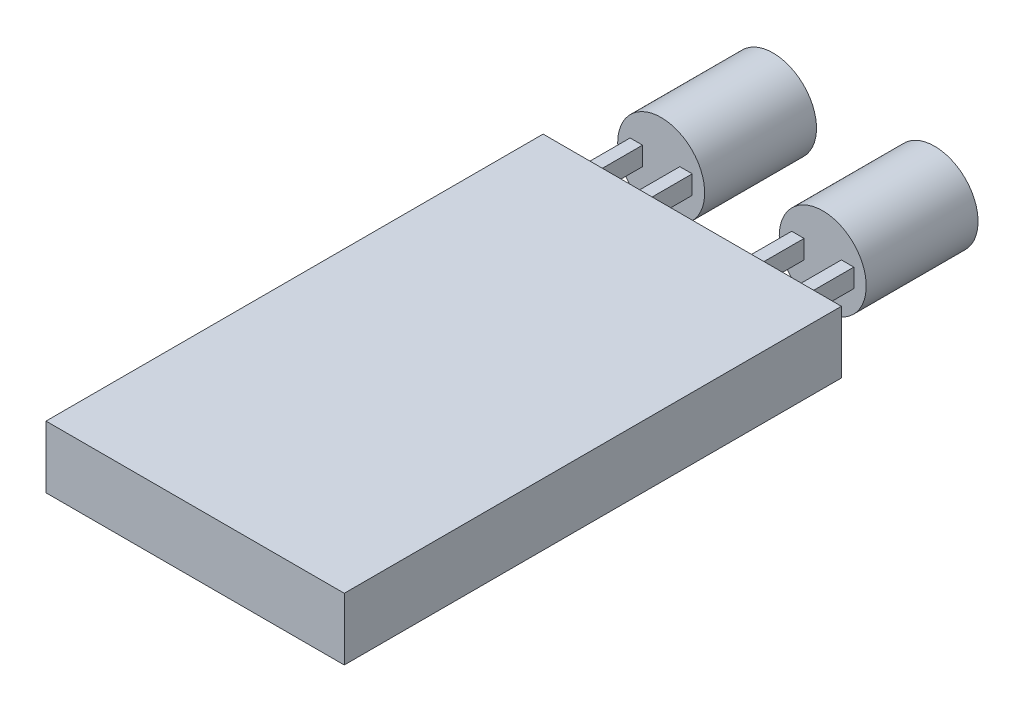
ISO-10303-21;
HEADER;
FILE_DESCRIPTION(('STEP AP214'),'2;1');
FILE_NAME('part.step','',(''),(''),'','','');
FILE_SCHEMA(('AUTOMOTIVE_DESIGN { 1 0 10303 214 1 1 1 1 }'));
ENDSEC;
DATA;
#1=APPLICATION_CONTEXT('core data for automotive mechanical design processes');
#2=APPLICATION_PROTOCOL_DEFINITION('international standard','automotive_design',2000,#1);
#3=PRODUCT_CONTEXT('',#1,'mechanical');
#4=PRODUCT('Part','Part','',(#3));
#5=PRODUCT_RELATED_PRODUCT_CATEGORY('part','',(#4));
#6=PRODUCT_DEFINITION_FORMATION('','',#4);
#7=PRODUCT_DEFINITION_CONTEXT('part definition',#1,'design');
#8=PRODUCT_DEFINITION('design','',#6,#7);
#9=PRODUCT_DEFINITION_SHAPE('','',#8);
#10=(LENGTH_UNIT() NAMED_UNIT(*) SI_UNIT(.MILLI.,.METRE.));
#11=(NAMED_UNIT(*) PLANE_ANGLE_UNIT() SI_UNIT($,.RADIAN.));
#12=(NAMED_UNIT(*) SI_UNIT($,.STERADIAN.) SOLID_ANGLE_UNIT());
#13=UNCERTAINTY_MEASURE_WITH_UNIT(LENGTH_MEASURE(1.E-05),#10,'distance_accuracy_value','');
#14=(GEOMETRIC_REPRESENTATION_CONTEXT(3) GLOBAL_UNCERTAINTY_ASSIGNED_CONTEXT((#13)) GLOBAL_UNIT_ASSIGNED_CONTEXT((#10,
#11,#12)) REPRESENTATION_CONTEXT('',''));
#15=CARTESIAN_POINT('',(0.,0.,0.));
#16=DIRECTION('',(0.,0.,1.));
#17=DIRECTION('',(1.,0.,0.));
#18=AXIS2_PLACEMENT_3D('',#15,#16,#17);
#19=CARTESIAN_POINT('',(-24.,5.,-9.42857142857144));
#20=DIRECTION('',(0.,0.,1.));
#21=DIRECTION('',(1.,0.,0.));
#22=AXIS2_PLACEMENT_3D('',#19,#20,#21);
#23=PLANE('',#22);
#24=DIRECTION('',(1.,0.,0.));
#25=VECTOR('',#24,1.);
#26=CARTESIAN_POINT('',(-16.,4.22951883751348,-9.42857142857144));
#27=LINE('',#26,#25);
#28=CARTESIAN_POINT('',(-17.,4.22951883751348,-9.42857142857144));
#29=VERTEX_POINT('',#28);
#30=CARTESIAN_POINT('',(-16.,4.22951883751348,-9.42857142857144));
#31=VERTEX_POINT('',#30);
#32=EDGE_CURVE('E211',#29,#31,#27,.T.);
#33=ORIENTED_EDGE('',*,*,#32,.F.);
#34=DIRECTION('',(0.,1.,0.));
#35=VECTOR('',#34,1.);
#36=CARTESIAN_POINT('',(-17.,4.22951883751348,-9.42857142857144));
#37=LINE('',#36,#35);
#38=CARTESIAN_POINT('',(-17.,2.72951883751348,-9.42857142857144));
#39=VERTEX_POINT('',#38);
#40=EDGE_CURVE('E216',#39,#29,#37,.T.);
#41=ORIENTED_EDGE('',*,*,#40,.F.);
#42=DIRECTION('',(-1.,0.,0.));
#43=VECTOR('',#42,1.);
#44=CARTESIAN_POINT('',(-16.,2.72951883751348,-9.42857142857144));
#45=LINE('',#44,#43);
#46=CARTESIAN_POINT('',(-16.,2.72951883751348,-9.42857142857144));
#47=VERTEX_POINT('',#46);
#48=EDGE_CURVE('E231',#47,#39,#45,.T.);
#49=ORIENTED_EDGE('',*,*,#48,.F.);
#50=DIRECTION('',(0.,-1.,0.));
#51=VECTOR('',#50,1.);
#52=CARTESIAN_POINT('',(-16.,4.22951883751348,-9.42857142857144));
#53=LINE('',#52,#51);
#54=EDGE_CURVE('E228',#31,#47,#53,.T.);
#55=ORIENTED_EDGE('',*,*,#54,.F.);
#56=EDGE_LOOP('',(#33,#41,#49,#55));
#57=FACE_BOUND('',#56,.T.);
#58=DIRECTION('',(0.,-1.,0.));
#59=VECTOR('',#58,1.);
#60=CARTESIAN_POINT('',(-3.,4.22951883751348,-9.42857142857144));
#61=LINE('',#60,#59);
#62=CARTESIAN_POINT('',(-3.,4.22951883751348,-9.42857142857144));
#63=VERTEX_POINT('',#62);
#64=CARTESIAN_POINT('',(-3.,2.72951883751348,-9.42857142857144));
#65=VERTEX_POINT('',#64);
#66=EDGE_CURVE('E283',#63,#65,#61,.T.);
#67=ORIENTED_EDGE('',*,*,#66,.F.);
#68=DIRECTION('',(1.,0.,0.));
#69=VECTOR('',#68,1.);
#70=CARTESIAN_POINT('',(-3.,4.22951883751348,-9.42857142857144));
#71=LINE('',#70,#69);
#72=CARTESIAN_POINT('',(-4.,4.22951883751348,-9.42857142857144));
#73=VERTEX_POINT('',#72);
#74=EDGE_CURVE('E288',#73,#63,#71,.T.);
#75=ORIENTED_EDGE('',*,*,#74,.F.);
#76=DIRECTION('',(0.,1.,0.));
#77=VECTOR('',#76,1.);
#78=CARTESIAN_POINT('',(-4.,4.22951883751348,-9.42857142857144));
#79=LINE('',#78,#77);
#80=CARTESIAN_POINT('',(-4.,2.72951883751348,-9.42857142857144));
#81=VERTEX_POINT('',#80);
#82=EDGE_CURVE('E303',#81,#73,#79,.T.);
#83=ORIENTED_EDGE('',*,*,#82,.F.);
#84=DIRECTION('',(-1.,0.,0.));
#85=VECTOR('',#84,1.);
#86=CARTESIAN_POINT('',(-3.,2.72951883751348,-9.42857142857144));
#87=LINE('',#86,#85);
#88=EDGE_CURVE('E300',#65,#81,#87,.T.);
#89=ORIENTED_EDGE('',*,*,#88,.F.);
#90=EDGE_LOOP('',(#67,#75,#83,#89));
#91=FACE_BOUND('',#90,.T.);
#92=DIRECTION('',(-1.,0.,0.));
#93=VECTOR('',#92,1.);
#94=CARTESIAN_POINT('',(-24.,0.,-9.42857142857144));
#95=LINE('',#94,#93);
#96=CARTESIAN_POINT('',(0.,0.,-9.42857142857144));
#97=VERTEX_POINT('',#96);
#98=CARTESIAN_POINT('',(-24.,0.,-9.42857142857144));
#99=VERTEX_POINT('',#98);
#100=EDGE_CURVE('E324',#97,#99,#95,.T.);
#101=ORIENTED_EDGE('',*,*,#100,.T.);
#102=DIRECTION('',(0.,-1.,0.));
#103=VECTOR('',#102,1.);
#104=CARTESIAN_POINT('',(-24.,5.,-9.42857142857144));
#105=LINE('',#104,#103);
#106=CARTESIAN_POINT('',(-24.,5.,-9.42857142857144));
#107=VERTEX_POINT('',#106);
#108=EDGE_CURVE('E330',#107,#99,#105,.T.);
#109=ORIENTED_EDGE('',*,*,#108,.F.);
#110=DIRECTION('',(-1.,0.,0.));
#111=VECTOR('',#110,1.);
#112=CARTESIAN_POINT('',(-24.,5.,-9.42857142857144));
#113=LINE('',#112,#111);
#114=CARTESIAN_POINT('',(0.,5.,-9.42857142857144));
#115=VERTEX_POINT('',#114);
#116=EDGE_CURVE('E328',#115,#107,#113,.T.);
#117=ORIENTED_EDGE('',*,*,#116,.F.);
#118=DIRECTION('',(0.,-1.,0.));
#119=VECTOR('',#118,1.);
#120=CARTESIAN_POINT('',(0.,5.,-9.42857142857144));
#121=LINE('',#120,#119);
#122=EDGE_CURVE('E340',#115,#97,#121,.T.);
#123=ORIENTED_EDGE('',*,*,#122,.T.);
#124=EDGE_LOOP('',(#101,#109,#117,#123));
#125=FACE_BOUND('',#124,.T.);
#126=DIRECTION('',(0.,-1.,0.));
#127=VECTOR('',#126,1.);
#128=CARTESIAN_POINT('',(-7.,4.22951883751349,-9.42857142857144));
#129=LINE('',#128,#127);
#130=CARTESIAN_POINT('',(-7.,4.22951883751349,-9.42857142857144));
#131=VERTEX_POINT('',#130);
#132=CARTESIAN_POINT('',(-7.,2.72951883751349,-9.42857142857144));
#133=VERTEX_POINT('',#132);
#134=EDGE_CURVE('E247',#131,#133,#129,.T.);
#135=ORIENTED_EDGE('',*,*,#134,.F.);
#136=DIRECTION('',(1.,0.,0.));
#137=VECTOR('',#136,1.);
#138=CARTESIAN_POINT('',(-7.,4.22951883751349,-9.42857142857144));
#139=LINE('',#138,#137);
#140=CARTESIAN_POINT('',(-8.,4.22951883751349,-9.42857142857144));
#141=VERTEX_POINT('',#140);
#142=EDGE_CURVE('E252',#141,#131,#139,.T.);
#143=ORIENTED_EDGE('',*,*,#142,.F.);
#144=DIRECTION('',(0.,1.,0.));
#145=VECTOR('',#144,1.);
#146=CARTESIAN_POINT('',(-8.,4.22951883751349,-9.42857142857144));
#147=LINE('',#146,#145);
#148=CARTESIAN_POINT('',(-8.,2.72951883751349,-9.42857142857144));
#149=VERTEX_POINT('',#148);
#150=EDGE_CURVE('E267',#149,#141,#147,.T.);
#151=ORIENTED_EDGE('',*,*,#150,.F.);
#152=DIRECTION('',(-1.,0.,0.));
#153=VECTOR('',#152,1.);
#154=CARTESIAN_POINT('',(-7.,2.72951883751349,-9.42857142857144));
#155=LINE('',#154,#153);
#156=EDGE_CURVE('E264',#133,#149,#155,.T.);
#157=ORIENTED_EDGE('',*,*,#156,.F.);
#158=EDGE_LOOP('',(#135,#143,#151,#157));
#159=FACE_BOUND('',#158,.T.);
#160=DIRECTION('',(1.,0.,0.));
#161=VECTOR('',#160,1.);
#162=CARTESIAN_POINT('',(-20.,4.22951883751349,-9.42857142857144));
#163=LINE('',#162,#161);
#164=CARTESIAN_POINT('',(-21.,4.22951883751349,-9.42857142857144));
#165=VERTEX_POINT('',#164);
#166=CARTESIAN_POINT('',(-20.,4.22951883751349,-9.42857142857144));
#167=VERTEX_POINT('',#166);
#168=EDGE_CURVE('E200',#165,#167,#163,.T.);
#169=ORIENTED_EDGE('',*,*,#168,.F.);
#170=DIRECTION('',(0.,1.,0.));
#171=VECTOR('',#170,1.);
#172=CARTESIAN_POINT('',(-21.,4.22951883751349,-9.42857142857144));
#173=LINE('',#172,#171);
#174=CARTESIAN_POINT('',(-21.,2.72951883751349,-9.42857142857144));
#175=VERTEX_POINT('',#174);
#176=EDGE_CURVE('E181',#175,#165,#173,.T.);
#177=ORIENTED_EDGE('',*,*,#176,.F.);
#178=DIRECTION('',(-1.,0.,0.));
#179=VECTOR('',#178,1.);
#180=CARTESIAN_POINT('',(-20.,2.72951883751349,-9.42857142857144));
#181=LINE('',#180,#179);
#182=CARTESIAN_POINT('',(-20.,2.72951883751349,-9.42857142857144));
#183=VERTEX_POINT('',#182);
#184=EDGE_CURVE('E55',#183,#175,#181,.T.);
#185=ORIENTED_EDGE('',*,*,#184,.F.);
#186=DIRECTION('',(0.,-1.,0.));
#187=VECTOR('',#186,1.);
#188=CARTESIAN_POINT('',(-20.,4.22951883751349,-9.42857142857144));
#189=LINE('',#188,#187);
#190=EDGE_CURVE('E50',#167,#183,#189,.T.);
#191=ORIENTED_EDGE('',*,*,#190,.F.);
#192=EDGE_LOOP('',(#169,#177,#185,#191));
#193=FACE_BOUND('',#192,.T.);
#194=ADVANCED_FACE('F35',(#57,#91,#125,#159,#193),#23,.F.);
#195=CARTESIAN_POINT('',(-24.,5.,-9.42857142857144));
#196=DIRECTION('',(1.,0.,0.));
#197=DIRECTION('',(0.,0.,-1.));
#198=AXIS2_PLACEMENT_3D('',#195,#196,#197);
#199=PLANE('',#198);
#200=DIRECTION('',(0.,0.,1.));
#201=VECTOR('',#200,1.);
#202=CARTESIAN_POINT('',(-24.,0.,-9.42857142857144));
#203=LINE('',#202,#201);
#204=CARTESIAN_POINT('',(-24.,0.,30.5714285714286));
#205=VERTEX_POINT('',#204);
#206=EDGE_CURVE('E319',#99,#205,#203,.T.);
#207=ORIENTED_EDGE('',*,*,#206,.T.);
#208=DIRECTION('',(0.,-1.,0.));
#209=VECTOR('',#208,1.);
#210=CARTESIAN_POINT('',(-24.,5.,30.5714285714286));
#211=LINE('',#210,#209);
#212=CARTESIAN_POINT('',(-24.,5.,30.5714285714286));
#213=VERTEX_POINT('',#212);
#214=EDGE_CURVE('E11',#213,#205,#211,.T.);
#215=ORIENTED_EDGE('',*,*,#214,.F.);
#216=DIRECTION('',(0.,0.,1.));
#217=VECTOR('',#216,1.);
#218=CARTESIAN_POINT('',(-24.,5.,-9.42857142857144));
#219=LINE('',#218,#217);
#220=EDGE_CURVE('E320',#107,#213,#219,.T.);
#221=ORIENTED_EDGE('',*,*,#220,.F.);
#222=ORIENTED_EDGE('',*,*,#108,.T.);
#223=EDGE_LOOP('',(#207,#215,#221,#222));
#224=FACE_BOUND('',#223,.T.);
#225=ADVANCED_FACE('F37',(#224),#199,.F.);
#226=CARTESIAN_POINT('',(-24.,5.,30.5714285714286));
#227=DIRECTION('',(0.,0.,-1.));
#228=DIRECTION('',(-1.,0.,0.));
#229=AXIS2_PLACEMENT_3D('',#226,#227,#228);
#230=PLANE('',#229);
#231=DIRECTION('',(1.,0.,0.));
#232=VECTOR('',#231,1.);
#233=CARTESIAN_POINT('',(-24.,0.,30.5714285714286));
#234=LINE('',#233,#232);
#235=CARTESIAN_POINT('',(0.,0.,30.5714285714286));
#236=VERTEX_POINT('',#235);
#237=EDGE_CURVE('E333',#205,#236,#234,.T.);
#238=ORIENTED_EDGE('',*,*,#237,.T.);
#239=DIRECTION('',(0.,-1.,0.));
#240=VECTOR('',#239,1.);
#241=CARTESIAN_POINT('',(0.,5.,30.5714285714286));
#242=LINE('',#241,#240);
#243=CARTESIAN_POINT('',(0.,5.,30.5714285714286));
#244=VERTEX_POINT('',#243);
#245=EDGE_CURVE('E43',#244,#236,#242,.T.);
#246=ORIENTED_EDGE('',*,*,#245,.F.);
#247=DIRECTION('',(1.,0.,0.));
#248=VECTOR('',#247,1.);
#249=CARTESIAN_POINT('',(-24.,5.,30.5714285714286));
#250=LINE('',#249,#248);
#251=EDGE_CURVE('E323',#213,#244,#250,.T.);
#252=ORIENTED_EDGE('',*,*,#251,.F.);
#253=ORIENTED_EDGE('',*,*,#214,.T.);
#254=EDGE_LOOP('',(#238,#246,#252,#253));
#255=FACE_BOUND('',#254,.T.);
#256=ADVANCED_FACE('F363',(#255),#230,.F.);
#257=CARTESIAN_POINT('',(0.,5.,-9.42857142857144));
#258=DIRECTION('',(-1.,0.,0.));
#259=DIRECTION('',(0.,0.,1.));
#260=AXIS2_PLACEMENT_3D('',#257,#258,#259);
#261=PLANE('',#260);
#262=DIRECTION('',(0.,0.,-1.));
#263=VECTOR('',#262,1.);
#264=CARTESIAN_POINT('',(0.,0.,-9.42857142857144));
#265=LINE('',#264,#263);
#266=EDGE_CURVE('E335',#236,#97,#265,.T.);
#267=ORIENTED_EDGE('',*,*,#266,.T.);
#268=ORIENTED_EDGE('',*,*,#122,.F.);
#269=DIRECTION('',(0.,0.,-1.));
#270=VECTOR('',#269,1.);
#271=CARTESIAN_POINT('',(0.,5.,-9.42857142857144));
#272=LINE('',#271,#270);
#273=EDGE_CURVE('E326',#244,#115,#272,.T.);
#274=ORIENTED_EDGE('',*,*,#273,.F.);
#275=ORIENTED_EDGE('',*,*,#245,.T.);
#276=EDGE_LOOP('',(#267,#268,#274,#275));
#277=FACE_BOUND('',#276,.T.);
#278=ADVANCED_FACE('F347',(#277),#261,.F.);
#279=CARTESIAN_POINT('',(0.,5.,0.));
#280=DIRECTION('',(0.,1.,0.));
#281=DIRECTION('',(0.,0.,1.));
#282=AXIS2_PLACEMENT_3D('',#279,#280,#281);
#283=PLANE('',#282);
#284=ORIENTED_EDGE('',*,*,#220,.T.);
#285=ORIENTED_EDGE('',*,*,#251,.T.);
#286=ORIENTED_EDGE('',*,*,#273,.T.);
#287=ORIENTED_EDGE('',*,*,#116,.T.);
#288=EDGE_LOOP('',(#284,#285,#286,#287));
#289=FACE_BOUND('',#288,.T.);
#290=ADVANCED_FACE('F362',(#289),#283,.T.);
#291=CARTESIAN_POINT('',(0.,0.,0.));
#292=DIRECTION('',(0.,1.,0.));
#293=DIRECTION('',(0.,0.,1.));
#294=AXIS2_PLACEMENT_3D('',#291,#292,#293);
#295=PLANE('',#294);
#296=ORIENTED_EDGE('',*,*,#206,.F.);
#297=ORIENTED_EDGE('',*,*,#100,.F.);
#298=ORIENTED_EDGE('',*,*,#266,.F.);
#299=ORIENTED_EDGE('',*,*,#237,.F.);
#300=EDGE_LOOP('',(#296,#297,#298,#299));
#301=FACE_BOUND('',#300,.T.);
#302=ADVANCED_FACE('F353',(#301),#295,.F.);
#303=CARTESIAN_POINT('',(-3.,4.22951883751348,-13.4285714285714));
#304=DIRECTION('',(-1.,0.,0.));
#305=DIRECTION('',(0.,0.,1.));
#306=AXIS2_PLACEMENT_3D('',#303,#304,#305);
#307=PLANE('',#306);
#308=ORIENTED_EDGE('',*,*,#66,.T.);
#309=DIRECTION('',(0.,0.,1.));
#310=VECTOR('',#309,1.);
#311=CARTESIAN_POINT('',(-3.,2.72951883751348,-13.4285714285714));
#312=LINE('',#311,#310);
#313=CARTESIAN_POINT('',(-3.,2.72951883751348,-13.4285714285714));
#314=VERTEX_POINT('',#313);
#315=EDGE_CURVE('E316',#314,#65,#312,.T.);
#316=ORIENTED_EDGE('',*,*,#315,.F.);
#317=DIRECTION('',(0.,-1.,0.));
#318=VECTOR('',#317,1.);
#319=CARTESIAN_POINT('',(-3.,4.22951883751348,-13.4285714285714));
#320=LINE('',#319,#318);
#321=CARTESIAN_POINT('',(-3.,4.22951883751348,-13.4285714285714));
#322=VERTEX_POINT('',#321);
#323=EDGE_CURVE('E284',#322,#314,#320,.T.);
#324=ORIENTED_EDGE('',*,*,#323,.F.);
#325=DIRECTION('',(0.,0.,1.));
#326=VECTOR('',#325,1.);
#327=CARTESIAN_POINT('',(-3.,4.22951883751348,-13.4285714285714));
#328=LINE('',#327,#326);
#329=EDGE_CURVE('E297',#322,#63,#328,.T.);
#330=ORIENTED_EDGE('',*,*,#329,.T.);
#331=EDGE_LOOP('',(#308,#316,#324,#330));
#332=FACE_BOUND('',#331,.T.);
#333=ADVANCED_FACE('F379',(#332),#307,.F.);
#334=CARTESIAN_POINT('',(-3.,2.72951883751348,-13.4285714285714));
#335=DIRECTION('',(0.,1.,0.));
#336=DIRECTION('',(0.,0.,1.));
#337=AXIS2_PLACEMENT_3D('',#334,#335,#336);
#338=PLANE('',#337);
#339=ORIENTED_EDGE('',*,*,#88,.T.);
#340=DIRECTION('',(0.,0.,1.));
#341=VECTOR('',#340,1.);
#342=CARTESIAN_POINT('',(-4.,2.72951883751348,-13.4285714285714));
#343=LINE('',#342,#341);
#344=CARTESIAN_POINT('',(-4.,2.72951883751348,-13.4285714285714));
#345=VERTEX_POINT('',#344);
#346=EDGE_CURVE('E313',#345,#81,#343,.T.);
#347=ORIENTED_EDGE('',*,*,#346,.F.);
#348=DIRECTION('',(-1.,0.,0.));
#349=VECTOR('',#348,1.);
#350=CARTESIAN_POINT('',(-3.,2.72951883751348,-13.4285714285714));
#351=LINE('',#350,#349);
#352=EDGE_CURVE('E287',#314,#345,#351,.T.);
#353=ORIENTED_EDGE('',*,*,#352,.F.);
#354=ORIENTED_EDGE('',*,*,#315,.T.);
#355=EDGE_LOOP('',(#339,#347,#353,#354));
#356=FACE_BOUND('',#355,.T.);
#357=ADVANCED_FACE('F384',(#356),#338,.F.);
#358=CARTESIAN_POINT('',(-4.,4.22951883751348,-13.4285714285714));
#359=DIRECTION('',(1.,0.,0.));
#360=DIRECTION('',(0.,0.,-1.));
#361=AXIS2_PLACEMENT_3D('',#358,#359,#360);
#362=PLANE('',#361);
#363=ORIENTED_EDGE('',*,*,#82,.T.);
#364=DIRECTION('',(0.,0.,1.));
#365=VECTOR('',#364,1.);
#366=CARTESIAN_POINT('',(-4.,4.22951883751348,-13.4285714285714));
#367=LINE('',#366,#365);
#368=CARTESIAN_POINT('',(-4.,4.22951883751348,-13.4285714285714));
#369=VERTEX_POINT('',#368);
#370=EDGE_CURVE('E310',#369,#73,#367,.T.);
#371=ORIENTED_EDGE('',*,*,#370,.F.);
#372=DIRECTION('',(0.,1.,0.));
#373=VECTOR('',#372,1.);
#374=CARTESIAN_POINT('',(-4.,4.22951883751348,-13.4285714285714));
#375=LINE('',#374,#373);
#376=EDGE_CURVE('E291',#345,#369,#375,.T.);
#377=ORIENTED_EDGE('',*,*,#376,.F.);
#378=ORIENTED_EDGE('',*,*,#346,.T.);
#379=EDGE_LOOP('',(#363,#371,#377,#378));
#380=FACE_BOUND('',#379,.T.);
#381=ADVANCED_FACE('F388',(#380),#362,.F.);
#382=CARTESIAN_POINT('',(-3.,4.22951883751348,-13.4285714285714));
#383=DIRECTION('',(0.,-1.,0.));
#384=DIRECTION('',(0.,0.,-1.));
#385=AXIS2_PLACEMENT_3D('',#382,#383,#384);
#386=PLANE('',#385);
#387=ORIENTED_EDGE('',*,*,#74,.T.);
#388=ORIENTED_EDGE('',*,*,#329,.F.);
#389=DIRECTION('',(1.,0.,0.));
#390=VECTOR('',#389,1.);
#391=CARTESIAN_POINT('',(-3.,4.22951883751348,-13.4285714285714));
#392=LINE('',#391,#390);
#393=EDGE_CURVE('E294',#369,#322,#392,.T.);
#394=ORIENTED_EDGE('',*,*,#393,.F.);
#395=ORIENTED_EDGE('',*,*,#370,.T.);
#396=EDGE_LOOP('',(#387,#388,#394,#395));
#397=FACE_BOUND('',#396,.T.);
#398=ADVANCED_FACE('F392',(#397),#386,.F.);
#399=CARTESIAN_POINT('',(-7.,4.22951883751349,-13.4285714285714));
#400=DIRECTION('',(-1.,0.,0.));
#401=DIRECTION('',(0.,0.,1.));
#402=AXIS2_PLACEMENT_3D('',#399,#400,#401);
#403=PLANE('',#402);
#404=ORIENTED_EDGE('',*,*,#134,.T.);
#405=DIRECTION('',(0.,0.,1.));
#406=VECTOR('',#405,1.);
#407=CARTESIAN_POINT('',(-7.,2.72951883751349,-13.4285714285714));
#408=LINE('',#407,#406);
#409=CARTESIAN_POINT('',(-7.,2.72951883751349,-13.4285714285714));
#410=VERTEX_POINT('',#409);
#411=EDGE_CURVE('E280',#410,#133,#408,.T.);
#412=ORIENTED_EDGE('',*,*,#411,.F.);
#413=DIRECTION('',(0.,-1.,0.));
#414=VECTOR('',#413,1.);
#415=CARTESIAN_POINT('',(-7.,4.22951883751349,-13.4285714285714));
#416=LINE('',#415,#414);
#417=CARTESIAN_POINT('',(-7.,4.22951883751349,-13.4285714285714));
#418=VERTEX_POINT('',#417);
#419=EDGE_CURVE('E248',#418,#410,#416,.T.);
#420=ORIENTED_EDGE('',*,*,#419,.F.);
#421=DIRECTION('',(0.,0.,1.));
#422=VECTOR('',#421,1.);
#423=CARTESIAN_POINT('',(-7.,4.22951883751349,-13.4285714285714));
#424=LINE('',#423,#422);
#425=EDGE_CURVE('E261',#418,#131,#424,.T.);
#426=ORIENTED_EDGE('',*,*,#425,.T.);
#427=EDGE_LOOP('',(#404,#412,#420,#426));
#428=FACE_BOUND('',#427,.T.);
#429=ADVANCED_FACE('F396',(#428),#403,.F.);
#430=CARTESIAN_POINT('',(-7.,2.72951883751349,-13.4285714285714));
#431=DIRECTION('',(0.,1.,0.));
#432=DIRECTION('',(-1.,0.,0.));
#433=AXIS2_PLACEMENT_3D('',#430,#431,#432);
#434=PLANE('',#433);
#435=ORIENTED_EDGE('',*,*,#156,.T.);
#436=DIRECTION('',(0.,0.,1.));
#437=VECTOR('',#436,1.);
#438=CARTESIAN_POINT('',(-8.,2.72951883751349,-13.4285714285714));
#439=LINE('',#438,#437);
#440=CARTESIAN_POINT('',(-8.,2.72951883751349,-13.4285714285714));
#441=VERTEX_POINT('',#440);
#442=EDGE_CURVE('E277',#441,#149,#439,.T.);
#443=ORIENTED_EDGE('',*,*,#442,.F.);
#444=DIRECTION('',(-1.,0.,0.));
#445=VECTOR('',#444,1.);
#446=CARTESIAN_POINT('',(-7.,2.72951883751349,-13.4285714285714));
#447=LINE('',#446,#445);
#448=EDGE_CURVE('E251',#410,#441,#447,.T.);
#449=ORIENTED_EDGE('',*,*,#448,.F.);
#450=ORIENTED_EDGE('',*,*,#411,.T.);
#451=EDGE_LOOP('',(#435,#443,#449,#450));
#452=FACE_BOUND('',#451,.T.);
#453=ADVANCED_FACE('F400',(#452),#434,.F.);
#454=CARTESIAN_POINT('',(-8.,4.22951883751349,-13.4285714285714));
#455=DIRECTION('',(1.,0.,0.));
#456=DIRECTION('',(0.,1.,0.));
#457=AXIS2_PLACEMENT_3D('',#454,#455,#456);
#458=PLANE('',#457);
#459=ORIENTED_EDGE('',*,*,#150,.T.);
#460=DIRECTION('',(0.,0.,1.));
#461=VECTOR('',#460,1.);
#462=CARTESIAN_POINT('',(-8.,4.22951883751349,-13.4285714285714));
#463=LINE('',#462,#461);
#464=CARTESIAN_POINT('',(-8.,4.22951883751349,-13.4285714285714));
#465=VERTEX_POINT('',#464);
#466=EDGE_CURVE('E274',#465,#141,#463,.T.);
#467=ORIENTED_EDGE('',*,*,#466,.F.);
#468=DIRECTION('',(0.,1.,0.));
#469=VECTOR('',#468,1.);
#470=CARTESIAN_POINT('',(-8.,4.22951883751349,-13.4285714285714));
#471=LINE('',#470,#469);
#472=EDGE_CURVE('E255',#441,#465,#471,.T.);
#473=ORIENTED_EDGE('',*,*,#472,.F.);
#474=ORIENTED_EDGE('',*,*,#442,.T.);
#475=EDGE_LOOP('',(#459,#467,#473,#474));
#476=FACE_BOUND('',#475,.T.);
#477=ADVANCED_FACE('F404',(#476),#458,.F.);
#478=CARTESIAN_POINT('',(-7.,4.22951883751349,-13.4285714285714));
#479=DIRECTION('',(0.,-1.,0.));
#480=DIRECTION('',(0.,0.,-1.));
#481=AXIS2_PLACEMENT_3D('',#478,#479,#480);
#482=PLANE('',#481);
#483=ORIENTED_EDGE('',*,*,#142,.T.);
#484=ORIENTED_EDGE('',*,*,#425,.F.);
#485=DIRECTION('',(1.,0.,0.));
#486=VECTOR('',#485,1.);
#487=CARTESIAN_POINT('',(-7.,4.22951883751349,-13.4285714285714));
#488=LINE('',#487,#486);
#489=EDGE_CURVE('E258',#465,#418,#488,.T.);
#490=ORIENTED_EDGE('',*,*,#489,.F.);
#491=ORIENTED_EDGE('',*,*,#466,.T.);
#492=EDGE_LOOP('',(#483,#484,#490,#491));
#493=FACE_BOUND('',#492,.T.);
#494=ADVANCED_FACE('F408',(#493),#482,.F.);
#495=CARTESIAN_POINT('',(-16.,4.22951883751348,-13.4285714285714));
#496=DIRECTION('',(0.,-1.,0.));
#497=DIRECTION('',(0.,0.,-1.));
#498=AXIS2_PLACEMENT_3D('',#495,#496,#497);
#499=PLANE('',#498);
#500=ORIENTED_EDGE('',*,*,#32,.T.);
#501=DIRECTION('',(0.,0.,1.));
#502=VECTOR('',#501,1.);
#503=CARTESIAN_POINT('',(-16.,4.22951883751348,-13.4285714285714));
#504=LINE('',#503,#502);
#505=CARTESIAN_POINT('',(-16.,4.22951883751348,-13.4285714285714));
#506=VERTEX_POINT('',#505);
#507=EDGE_CURVE('E244',#506,#31,#504,.T.);
#508=ORIENTED_EDGE('',*,*,#507,.F.);
#509=DIRECTION('',(1.,0.,0.));
#510=VECTOR('',#509,1.);
#511=CARTESIAN_POINT('',(-16.,4.22951883751348,-13.4285714285714));
#512=LINE('',#511,#510);
#513=CARTESIAN_POINT('',(-17.,4.22951883751348,-13.4285714285714));
#514=VERTEX_POINT('',#513);
#515=EDGE_CURVE('E212',#514,#506,#512,.T.);
#516=ORIENTED_EDGE('',*,*,#515,.F.);
#517=DIRECTION('',(0.,0.,1.));
#518=VECTOR('',#517,1.);
#519=CARTESIAN_POINT('',(-17.,4.22951883751348,-13.4285714285714));
#520=LINE('',#519,#518);
#521=EDGE_CURVE('E225',#514,#29,#520,.T.);
#522=ORIENTED_EDGE('',*,*,#521,.T.);
#523=EDGE_LOOP('',(#500,#508,#516,#522));
#524=FACE_BOUND('',#523,.T.);
#525=ADVANCED_FACE('F412',(#524),#499,.F.);
#526=CARTESIAN_POINT('',(-16.,4.22951883751348,-13.4285714285714));
#527=DIRECTION('',(-1.,0.,0.));
#528=DIRECTION('',(0.,0.,1.));
#529=AXIS2_PLACEMENT_3D('',#526,#527,#528);
#530=PLANE('',#529);
#531=ORIENTED_EDGE('',*,*,#54,.T.);
#532=DIRECTION('',(0.,0.,1.));
#533=VECTOR('',#532,1.);
#534=CARTESIAN_POINT('',(-16.,2.72951883751348,-13.4285714285714));
#535=LINE('',#534,#533);
#536=CARTESIAN_POINT('',(-16.,2.72951883751348,-13.4285714285714));
#537=VERTEX_POINT('',#536);
#538=EDGE_CURVE('E241',#537,#47,#535,.T.);
#539=ORIENTED_EDGE('',*,*,#538,.F.);
#540=DIRECTION('',(0.,-1.,0.));
#541=VECTOR('',#540,1.);
#542=CARTESIAN_POINT('',(-16.,4.22951883751348,-13.4285714285714));
#543=LINE('',#542,#541);
#544=EDGE_CURVE('E215',#506,#537,#543,.T.);
#545=ORIENTED_EDGE('',*,*,#544,.F.);
#546=ORIENTED_EDGE('',*,*,#507,.T.);
#547=EDGE_LOOP('',(#531,#539,#545,#546));
#548=FACE_BOUND('',#547,.T.);
#549=ADVANCED_FACE('F416',(#548),#530,.F.);
#550=CARTESIAN_POINT('',(-16.,2.72951883751348,-13.4285714285714));
#551=DIRECTION('',(0.,1.,0.));
#552=DIRECTION('',(0.,0.,1.));
#553=AXIS2_PLACEMENT_3D('',#550,#551,#552);
#554=PLANE('',#553);
#555=ORIENTED_EDGE('',*,*,#48,.T.);
#556=DIRECTION('',(0.,0.,1.));
#557=VECTOR('',#556,1.);
#558=CARTESIAN_POINT('',(-17.,2.72951883751348,-13.4285714285714));
#559=LINE('',#558,#557);
#560=CARTESIAN_POINT('',(-17.,2.72951883751348,-13.4285714285714));
#561=VERTEX_POINT('',#560);
#562=EDGE_CURVE('E238',#561,#39,#559,.T.);
#563=ORIENTED_EDGE('',*,*,#562,.F.);
#564=DIRECTION('',(-1.,0.,0.));
#565=VECTOR('',#564,1.);
#566=CARTESIAN_POINT('',(-16.,2.72951883751348,-13.4285714285714));
#567=LINE('',#566,#565);
#568=EDGE_CURVE('E219',#537,#561,#567,.T.);
#569=ORIENTED_EDGE('',*,*,#568,.F.);
#570=ORIENTED_EDGE('',*,*,#538,.T.);
#571=EDGE_LOOP('',(#555,#563,#569,#570));
#572=FACE_BOUND('',#571,.T.);
#573=ADVANCED_FACE('F420',(#572),#554,.F.);
#574=CARTESIAN_POINT('',(-17.,4.22951883751348,-13.4285714285714));
#575=DIRECTION('',(1.,0.,0.));
#576=DIRECTION('',(0.,0.,-1.));
#577=AXIS2_PLACEMENT_3D('',#574,#575,#576);
#578=PLANE('',#577);
#579=ORIENTED_EDGE('',*,*,#40,.T.);
#580=ORIENTED_EDGE('',*,*,#521,.F.);
#581=DIRECTION('',(0.,1.,0.));
#582=VECTOR('',#581,1.);
#583=CARTESIAN_POINT('',(-17.,4.22951883751348,-13.4285714285714));
#584=LINE('',#583,#582);
#585=EDGE_CURVE('E222',#561,#514,#584,.T.);
#586=ORIENTED_EDGE('',*,*,#585,.F.);
#587=ORIENTED_EDGE('',*,*,#562,.T.);
#588=EDGE_LOOP('',(#579,#580,#586,#587));
#589=FACE_BOUND('',#588,.T.);
#590=ADVANCED_FACE('F424',(#589),#578,.F.);
#591=CARTESIAN_POINT('',(-20.,4.22951883751349,-13.4285714285714));
#592=DIRECTION('',(0.,-1.,0.));
#593=DIRECTION('',(0.,0.,-1.));
#594=AXIS2_PLACEMENT_3D('',#591,#592,#593);
#595=PLANE('',#594);
#596=ORIENTED_EDGE('',*,*,#168,.T.);
#597=DIRECTION('',(0.,0.,1.));
#598=VECTOR('',#597,1.);
#599=CARTESIAN_POINT('',(-20.,4.22951883751349,-13.4285714285714));
#600=LINE('',#599,#598);
#601=CARTESIAN_POINT('',(-20.,4.22951883751349,-13.4285714285714));
#602=VERTEX_POINT('',#601);
#603=EDGE_CURVE('E176',#602,#167,#600,.T.);
#604=ORIENTED_EDGE('',*,*,#603,.F.);
#605=DIRECTION('',(1.,0.,0.));
#606=VECTOR('',#605,1.);
#607=CARTESIAN_POINT('',(-20.,4.22951883751349,-13.4285714285714));
#608=LINE('',#607,#606);
#609=CARTESIAN_POINT('',(-21.,4.22951883751349,-13.4285714285714));
#610=VERTEX_POINT('',#609);
#611=EDGE_CURVE('E171',#610,#602,#608,.T.);
#612=ORIENTED_EDGE('',*,*,#611,.F.);
#613=DIRECTION('',(0.,0.,1.));
#614=VECTOR('',#613,1.);
#615=CARTESIAN_POINT('',(-21.,4.22951883751349,-13.4285714285714));
#616=LINE('',#615,#614);
#617=EDGE_CURVE('E175',#610,#165,#616,.T.);
#618=ORIENTED_EDGE('',*,*,#617,.T.);
#619=EDGE_LOOP('',(#596,#604,#612,#618));
#620=FACE_BOUND('',#619,.T.);
#621=ADVANCED_FACE('F174',(#620),#595,.F.);
#622=CARTESIAN_POINT('',(-20.,4.22951883751349,-13.4285714285714));
#623=DIRECTION('',(-1.,0.,0.));
#624=DIRECTION('',(0.,0.,1.));
#625=AXIS2_PLACEMENT_3D('',#622,#623,#624);
#626=PLANE('',#625);
#627=ORIENTED_EDGE('',*,*,#190,.T.);
#628=DIRECTION('',(0.,0.,1.));
#629=VECTOR('',#628,1.);
#630=CARTESIAN_POINT('',(-20.,2.72951883751349,-13.4285714285714));
#631=LINE('',#630,#629);
#632=CARTESIAN_POINT('',(-20.,2.72951883751349,-13.4285714285714));
#633=VERTEX_POINT('',#632);
#634=EDGE_CURVE('E207',#633,#183,#631,.T.);
#635=ORIENTED_EDGE('',*,*,#634,.F.);
#636=DIRECTION('',(0.,-1.,0.));
#637=VECTOR('',#636,1.);
#638=CARTESIAN_POINT('',(-20.,4.22951883751349,-13.4285714285714));
#639=LINE('',#638,#637);
#640=EDGE_CURVE('E180',#602,#633,#639,.T.);
#641=ORIENTED_EDGE('',*,*,#640,.F.);
#642=ORIENTED_EDGE('',*,*,#603,.T.);
#643=EDGE_LOOP('',(#627,#635,#641,#642));
#644=FACE_BOUND('',#643,.T.);
#645=ADVANCED_FACE('F431',(#644),#626,.F.);
#646=CARTESIAN_POINT('',(-20.,2.72951883751349,-13.4285714285714));
#647=DIRECTION('',(0.,1.,0.));
#648=DIRECTION('',(-1.,0.,0.));
#649=AXIS2_PLACEMENT_3D('',#646,#647,#648);
#650=PLANE('',#649);
#651=ORIENTED_EDGE('',*,*,#184,.T.);
#652=DIRECTION('',(0.,0.,1.));
#653=VECTOR('',#652,1.);
#654=CARTESIAN_POINT('',(-21.,2.72951883751349,-13.4285714285714));
#655=LINE('',#654,#653);
#656=CARTESIAN_POINT('',(-21.,2.72951883751349,-13.4285714285714));
#657=VERTEX_POINT('',#656);
#658=EDGE_CURVE('E190',#657,#175,#655,.T.);
#659=ORIENTED_EDGE('',*,*,#658,.F.);
#660=DIRECTION('',(-1.,0.,0.));
#661=VECTOR('',#660,1.);
#662=CARTESIAN_POINT('',(-20.,2.72951883751349,-13.4285714285714));
#663=LINE('',#662,#661);
#664=EDGE_CURVE('E195',#633,#657,#663,.T.);
#665=ORIENTED_EDGE('',*,*,#664,.F.);
#666=ORIENTED_EDGE('',*,*,#634,.T.);
#667=EDGE_LOOP('',(#651,#659,#665,#666));
#668=FACE_BOUND('',#667,.T.);
#669=ADVANCED_FACE('F434',(#668),#650,.F.);
#670=CARTESIAN_POINT('',(-21.,4.22951883751349,-13.4285714285714));
#671=DIRECTION('',(1.,0.,0.));
#672=DIRECTION('',(0.,0.,-1.));
#673=AXIS2_PLACEMENT_3D('',#670,#671,#672);
#674=PLANE('',#673);
#675=ORIENTED_EDGE('',*,*,#176,.T.);
#676=ORIENTED_EDGE('',*,*,#617,.F.);
#677=DIRECTION('',(0.,1.,0.));
#678=VECTOR('',#677,1.);
#679=CARTESIAN_POINT('',(-21.,4.22951883751349,-13.4285714285714));
#680=LINE('',#679,#678);
#681=EDGE_CURVE('E188',#657,#610,#680,.T.);
#682=ORIENTED_EDGE('',*,*,#681,.F.);
#683=ORIENTED_EDGE('',*,*,#658,.T.);
#684=EDGE_LOOP('',(#675,#676,#682,#683));
#685=FACE_BOUND('',#684,.T.);
#686=ADVANCED_FACE('F186',(#685),#674,.F.);
#687=CARTESIAN_POINT('',(-5.5,3.40608752970275,-13.4285714285714));
#688=DIRECTION('',(0.,0.,-1.));
#689=DIRECTION('',(-1.,0.,0.));
#690=AXIS2_PLACEMENT_3D('',#687,#688,#689);
#691=PLANE('',#690);
#692=ORIENTED_EDGE('',*,*,#489,.T.);
#693=ORIENTED_EDGE('',*,*,#419,.T.);
#694=ORIENTED_EDGE('',*,*,#448,.T.);
#695=ORIENTED_EDGE('',*,*,#472,.T.);
#696=EDGE_LOOP('',(#692,#693,#694,#695));
#697=FACE_BOUND('',#696,.T.);
#698=CARTESIAN_POINT('',(-5.5,3.40608752970275,-13.4285714285714));
#699=DIRECTION('',(0.,0.,-1.));
#700=DIRECTION('',(-1.,0.,0.));
#701=AXIS2_PLACEMENT_3D('',#698,#699,#700);
#702=CIRCLE('',#701,3.5);
#703=CARTESIAN_POINT('',(-9.,3.40608752970275,-13.4285714285714));
#704=VERTEX_POINT('',#703);
#705=EDGE_CURVE('E467',#704,#704,#702,.T.);
#706=ORIENTED_EDGE('',*,*,#705,.F.);
#707=EDGE_LOOP('',(#706));
#708=FACE_BOUND('',#707,.T.);
#709=ORIENTED_EDGE('',*,*,#393,.T.);
#710=ORIENTED_EDGE('',*,*,#323,.T.);
#711=ORIENTED_EDGE('',*,*,#352,.T.);
#712=ORIENTED_EDGE('',*,*,#376,.T.);
#713=EDGE_LOOP('',(#709,#710,#711,#712));
#714=FACE_BOUND('',#713,.T.);
#715=ADVANCED_FACE('F441',(#697,#708,#714),#691,.F.);
#716=CARTESIAN_POINT('',(-5.5,3.40608752970275,-22.4285714285714));
#717=DIRECTION('',(0.,0.,1.));
#718=DIRECTION('',(1.,0.,0.));
#719=AXIS2_PLACEMENT_3D('',#716,#717,#718);
#720=CYLINDRICAL_SURFACE('',#719,3.5);
#721=CARTESIAN_POINT('',(-5.5,3.40608752970275,-22.4285714285714));
#722=DIRECTION('',(0.,0.,-1.));
#723=DIRECTION('',(-1.,0.,0.));
#724=AXIS2_PLACEMENT_3D('',#721,#722,#723);
#725=CIRCLE('',#724,3.5);
#726=CARTESIAN_POINT('',(-9.,3.40608752970275,-22.4285714285714));
#727=VERTEX_POINT('',#726);
#728=EDGE_CURVE('E202',#727,#727,#725,.T.);
#729=ORIENTED_EDGE('',*,*,#728,.F.);
#730=EDGE_LOOP('',(#729));
#731=FACE_BOUND('',#730,.T.);
#732=ORIENTED_EDGE('',*,*,#705,.T.);
#733=EDGE_LOOP('',(#732));
#734=FACE_BOUND('',#733,.T.);
#735=ADVANCED_FACE('F442',(#731,#734),#720,.T.);
#736=CARTESIAN_POINT('',(-5.5,3.40608752970275,-22.4285714285714));
#737=DIRECTION('',(0.,0.,-1.));
#738=DIRECTION('',(-1.,0.,0.));
#739=AXIS2_PLACEMENT_3D('',#736,#737,#738);
#740=PLANE('',#739);
#741=ORIENTED_EDGE('',*,*,#728,.T.);
#742=EDGE_LOOP('',(#741));
#743=FACE_BOUND('',#742,.T.);
#744=ADVANCED_FACE('F445',(#743),#740,.T.);
#745=CARTESIAN_POINT('',(-18.5,3.40608752970275,-13.4285714285714));
#746=DIRECTION('',(0.,0.,-1.));
#747=DIRECTION('',(-1.,0.,0.));
#748=AXIS2_PLACEMENT_3D('',#745,#746,#747);
#749=PLANE('',#748);
#750=ORIENTED_EDGE('',*,*,#681,.T.);
#751=ORIENTED_EDGE('',*,*,#611,.T.);
#752=ORIENTED_EDGE('',*,*,#640,.T.);
#753=ORIENTED_EDGE('',*,*,#664,.T.);
#754=EDGE_LOOP('',(#750,#751,#752,#753));
#755=FACE_BOUND('',#754,.T.);
#756=CARTESIAN_POINT('',(-18.5,3.40608752970275,-13.4285714285714));
#757=DIRECTION('',(0.,0.,-1.));
#758=DIRECTION('',(-1.,0.,0.));
#759=AXIS2_PLACEMENT_3D('',#756,#757,#758);
#760=CIRCLE('',#759,3.5);
#761=CARTESIAN_POINT('',(-22.,3.40608752970275,-13.4285714285714));
#762=VERTEX_POINT('',#761);
#763=EDGE_CURVE('E468',#762,#762,#760,.T.);
#764=ORIENTED_EDGE('',*,*,#763,.F.);
#765=EDGE_LOOP('',(#764));
#766=FACE_BOUND('',#765,.T.);
#767=ORIENTED_EDGE('',*,*,#585,.T.);
#768=ORIENTED_EDGE('',*,*,#515,.T.);
#769=ORIENTED_EDGE('',*,*,#544,.T.);
#770=ORIENTED_EDGE('',*,*,#568,.T.);
#771=EDGE_LOOP('',(#767,#768,#769,#770));
#772=FACE_BOUND('',#771,.T.);
#773=ADVANCED_FACE('F192',(#755,#766,#772),#749,.F.);
#774=CARTESIAN_POINT('',(-18.5,3.40608752970275,-22.4285714285714));
#775=DIRECTION('',(0.,0.,1.));
#776=DIRECTION('',(1.,0.,0.));
#777=AXIS2_PLACEMENT_3D('',#774,#775,#776);
#778=CYLINDRICAL_SURFACE('',#777,3.5);
#779=CARTESIAN_POINT('',(-18.5,3.40608752970275,-22.4285714285714));
#780=DIRECTION('',(0.,0.,-1.));
#781=DIRECTION('',(-1.,0.,0.));
#782=AXIS2_PLACEMENT_3D('',#779,#780,#781);
#783=CIRCLE('',#782,3.5);
#784=CARTESIAN_POINT('',(-22.,3.40608752970275,-22.4285714285714));
#785=VERTEX_POINT('',#784);
#786=EDGE_CURVE('E466',#785,#785,#783,.T.);
#787=ORIENTED_EDGE('',*,*,#786,.F.);
#788=EDGE_LOOP('',(#787));
#789=FACE_BOUND('',#788,.T.);
#790=ORIENTED_EDGE('',*,*,#763,.T.);
#791=EDGE_LOOP('',(#790));
#792=FACE_BOUND('',#791,.T.);
#793=ADVANCED_FACE('F453',(#789,#792),#778,.T.);
#794=CARTESIAN_POINT('',(-18.5,3.40608752970275,-22.4285714285714));
#795=DIRECTION('',(0.,0.,-1.));
#796=DIRECTION('',(-1.,0.,0.));
#797=AXIS2_PLACEMENT_3D('',#794,#795,#796);
#798=PLANE('',#797);
#799=ORIENTED_EDGE('',*,*,#786,.T.);
#800=EDGE_LOOP('',(#799));
#801=FACE_BOUND('',#800,.T.);
#802=ADVANCED_FACE('F456',(#801),#798,.T.);
#803=CLOSED_SHELL('',(#194,#225,#256,#278,#290,#302,#333,#357,#381,#398,#429,#453,#477,#494,
#525,#549,#573,#590,#621,#645,#669,#686,#715,#735,#744,#773,#793,#802));
#804=MANIFOLD_SOLID_BREP('B2',#803);
#805=ADVANCED_BREP_SHAPE_REPRESENTATION('',(#18,#804),#14);
#806=SHAPE_DEFINITION_REPRESENTATION(#9,#805);
ENDSEC;
END-ISO-10303-21;
